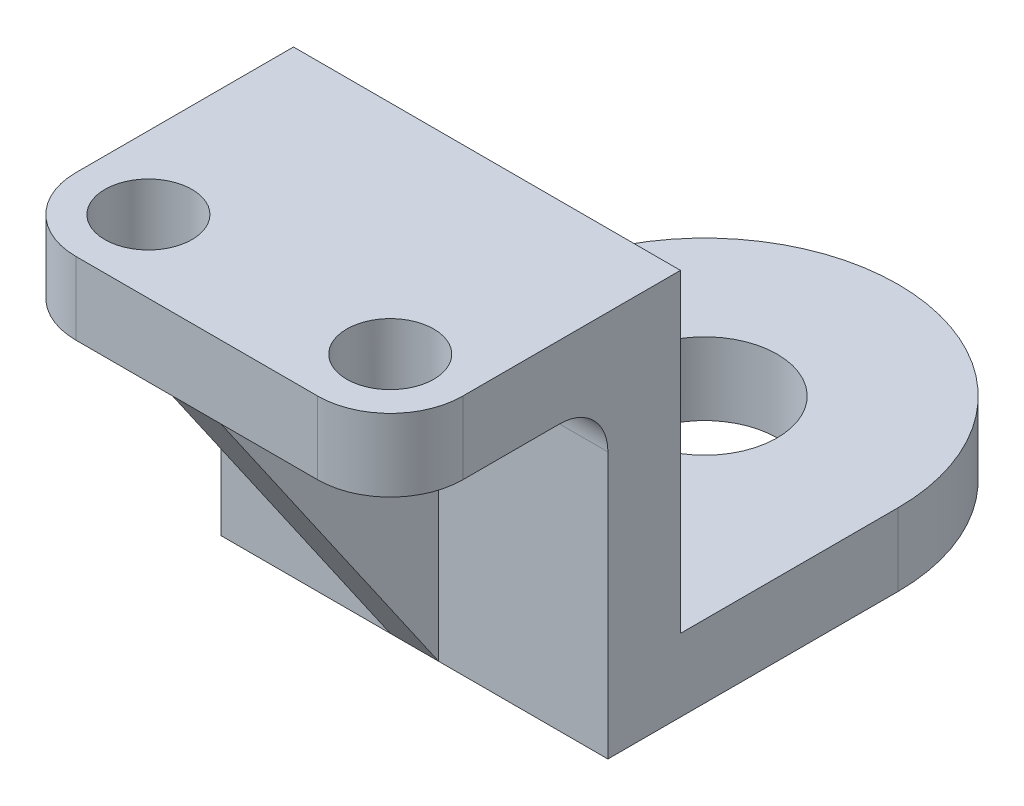
ISO-10303-21;
HEADER;
FILE_DESCRIPTION(('STEP AP214'),'2;1');
FILE_NAME('part.step','',(''),(''),'','','');
FILE_SCHEMA(('AUTOMOTIVE_DESIGN { 1 0 10303 214 1 1 1 1 }'));
ENDSEC;
DATA;
#1=APPLICATION_CONTEXT('core data for automotive mechanical design processes');
#2=APPLICATION_PROTOCOL_DEFINITION('international standard','automotive_design',2000,#1);
#3=PRODUCT_CONTEXT('',#1,'mechanical');
#4=PRODUCT('Part','Part','',(#3));
#5=PRODUCT_RELATED_PRODUCT_CATEGORY('part','',(#4));
#6=PRODUCT_DEFINITION_FORMATION('','',#4);
#7=PRODUCT_DEFINITION_CONTEXT('part definition',#1,'design');
#8=PRODUCT_DEFINITION('design','',#6,#7);
#9=PRODUCT_DEFINITION_SHAPE('','',#8);
#10=(LENGTH_UNIT() NAMED_UNIT(*) SI_UNIT(.MILLI.,.METRE.));
#11=(NAMED_UNIT(*) PLANE_ANGLE_UNIT() SI_UNIT($,.RADIAN.));
#12=(NAMED_UNIT(*) SI_UNIT($,.STERADIAN.) SOLID_ANGLE_UNIT());
#13=UNCERTAINTY_MEASURE_WITH_UNIT(LENGTH_MEASURE(1.E-05),#10,'distance_accuracy_value','');
#14=(GEOMETRIC_REPRESENTATION_CONTEXT(3) GLOBAL_UNCERTAINTY_ASSIGNED_CONTEXT((#13)) GLOBAL_UNIT_ASSIGNED_CONTEXT((#10,
#11,#12)) REPRESENTATION_CONTEXT('',''));
#15=CARTESIAN_POINT('',(0.,0.,0.));
#16=DIRECTION('',(0.,0.,1.));
#17=DIRECTION('',(1.,0.,0.));
#18=AXIS2_PLACEMENT_3D('',#15,#16,#17);
#19=CARTESIAN_POINT('',(40.,0.,100.));
#20=DIRECTION('',(0.,0.,-1.));
#21=DIRECTION('',(0.,1.,0.));
#22=AXIS2_PLACEMENT_3D('',#19,#20,#21);
#23=PLANE('',#22);
#24=DIRECTION('',(0.,-1.,0.));
#25=VECTOR('',#24,1.);
#26=CARTESIAN_POINT('',(-5.,0.,100.));
#27=LINE('',#26,#25);
#28=CARTESIAN_POINT('',(-5.,-25.,100.));
#29=VERTEX_POINT('',#28);
#30=CARTESIAN_POINT('',(-5.,-80.,100.));
#31=VERTEX_POINT('',#30);
#32=EDGE_CURVE('E166',#29,#31,#27,.T.);
#33=ORIENTED_EDGE('',*,*,#32,.F.);
#34=DIRECTION('',(-1.,0.,0.));
#35=VECTOR('',#34,1.);
#36=CARTESIAN_POINT('',(-40.,-25.,100.));
#37=LINE('',#36,#35);
#38=CARTESIAN_POINT('',(-40.,-25.,100.));
#39=VERTEX_POINT('',#38);
#40=EDGE_CURVE('E155',#29,#39,#37,.T.);
#41=ORIENTED_EDGE('',*,*,#40,.T.);
#42=DIRECTION('',(0.,-1.,0.));
#43=VECTOR('',#42,1.);
#44=CARTESIAN_POINT('',(-40.,0.,100.));
#45=LINE('',#44,#43);
#46=CARTESIAN_POINT('',(-40.,-80.,100.));
#47=VERTEX_POINT('',#46);
#48=EDGE_CURVE('E240',#39,#47,#45,.T.);
#49=ORIENTED_EDGE('',*,*,#48,.T.);
#50=DIRECTION('',(-1.,0.,0.));
#51=VECTOR('',#50,1.);
#52=CARTESIAN_POINT('',(40.,-80.,100.));
#53=LINE('',#52,#51);
#54=EDGE_CURVE('E56',#31,#47,#53,.T.);
#55=ORIENTED_EDGE('',*,*,#54,.F.);
#56=EDGE_LOOP('',(#33,#41,#49,#55));
#57=FACE_BOUND('',#56,.T.);
#58=ADVANCED_FACE('F41',(#57),#23,.F.);
#59=CARTESIAN_POINT('',(40.,-15.,145.));
#60=DIRECTION('',(0.,1.,0.));
#61=DIRECTION('',(0.,0.,1.));
#62=AXIS2_PLACEMENT_3D('',#59,#60,#61);
#63=PLANE('',#62);
#64=CARTESIAN_POINT('',(-25.,-15.,130.));
#65=DIRECTION('',(0.,1.,0.));
#66=DIRECTION('',(0.,0.,1.));
#67=AXIS2_PLACEMENT_3D('',#64,#65,#66);
#68=CIRCLE('',#67,9.00000000000001);
#69=CARTESIAN_POINT('',(-25.,-15.,139.));
#70=VERTEX_POINT('',#69);
#71=EDGE_CURVE('E204',#70,#70,#68,.T.);
#72=ORIENTED_EDGE('',*,*,#71,.T.);
#73=EDGE_LOOP('',(#72));
#74=FACE_BOUND('',#73,.T.);
#75=DIRECTION('',(0.,0.,-1.));
#76=VECTOR('',#75,1.);
#77=CARTESIAN_POINT('',(-5.,-15.,145.));
#78=LINE('',#77,#76);
#79=CARTESIAN_POINT('',(-5.,-15.,145.));
#80=VERTEX_POINT('',#79);
#81=CARTESIAN_POINT('',(-5.,-15.,110.));
#82=VERTEX_POINT('',#81);
#83=EDGE_CURVE('E171',#80,#82,#78,.T.);
#84=ORIENTED_EDGE('',*,*,#83,.F.);
#85=DIRECTION('',(-1.,0.,0.));
#86=VECTOR('',#85,1.);
#87=CARTESIAN_POINT('',(40.,-15.,145.));
#88=LINE('',#87,#86);
#89=CARTESIAN_POINT('',(-25.,-15.,145.));
#90=VERTEX_POINT('',#89);
#91=EDGE_CURVE('E266',#80,#90,#88,.T.);
#92=ORIENTED_EDGE('',*,*,#91,.T.);
#93=CARTESIAN_POINT('',(-25.,-15.,130.));
#94=DIRECTION('',(0.,1.,0.));
#95=DIRECTION('',(0.,0.,1.));
#96=AXIS2_PLACEMENT_3D('',#93,#94,#95);
#97=CIRCLE('',#96,15.);
#98=CARTESIAN_POINT('',(-40.,-15.,130.));
#99=VERTEX_POINT('',#98);
#100=EDGE_CURVE('E225',#90,#99,#97,.F.);
#101=ORIENTED_EDGE('',*,*,#100,.T.);
#102=DIRECTION('',(0.,0.,-1.));
#103=VECTOR('',#102,1.);
#104=CARTESIAN_POINT('',(-40.,-15.,145.));
#105=LINE('',#104,#103);
#106=CARTESIAN_POINT('',(-40.,-15.,110.));
#107=VERTEX_POINT('',#106);
#108=EDGE_CURVE('E207',#99,#107,#105,.T.);
#109=ORIENTED_EDGE('',*,*,#108,.T.);
#110=DIRECTION('',(-1.,0.,0.));
#111=VECTOR('',#110,1.);
#112=CARTESIAN_POINT('',(40.,-15.,110.));
#113=LINE('',#112,#111);
#114=EDGE_CURVE('E179',#107,#82,#113,.F.);
#115=ORIENTED_EDGE('',*,*,#114,.T.);
#116=EDGE_LOOP('',(#84,#92,#101,#109,#115));
#117=FACE_BOUND('',#116,.T.);
#118=ADVANCED_FACE('F324',(#74,#117),#63,.F.);
#119=CARTESIAN_POINT('',(40.,-25.,110.));
#120=DIRECTION('',(1.,0.,0.));
#121=DIRECTION('',(0.,0.,-1.));
#122=AXIS2_PLACEMENT_3D('',#119,#120,#121);
#123=CYLINDRICAL_SURFACE('',#122,10.);
#124=CARTESIAN_POINT('',(-5.,-25.,110.));
#125=DIRECTION('',(1.,0.,0.));
#126=DIRECTION('',(0.,0.,-1.));
#127=AXIS2_PLACEMENT_3D('',#124,#125,#126);
#128=CIRCLE('',#127,10.);
#129=EDGE_CURVE('E49',#82,#29,#128,.F.);
#130=ORIENTED_EDGE('',*,*,#129,.F.);
#131=ORIENTED_EDGE('',*,*,#114,.F.);
#132=CARTESIAN_POINT('',(-40.,-25.,110.));
#133=DIRECTION('',(1.,0.,0.));
#134=DIRECTION('',(0.,0.,-1.));
#135=AXIS2_PLACEMENT_3D('',#132,#133,#134);
#136=CIRCLE('',#135,10.);
#137=EDGE_CURVE('E160',#39,#107,#136,.T.);
#138=ORIENTED_EDGE('',*,*,#137,.F.);
#139=ORIENTED_EDGE('',*,*,#40,.F.);
#140=EDGE_LOOP('',(#130,#131,#138,#139));
#141=FACE_BOUND('',#140,.T.);
#142=ADVANCED_FACE('F156',(#141),#123,.F.);
#143=CARTESIAN_POINT('',(40.,-65.,0.));
#144=DIRECTION('',(0.,-1.,0.));
#145=DIRECTION('',(0.,0.,-1.));
#146=AXIS2_PLACEMENT_3D('',#143,#144,#145);
#147=PLANE('',#146);
#148=CARTESIAN_POINT('',(0.,-65.,40.));
#149=DIRECTION('',(0.,-1.,0.));
#150=DIRECTION('',(0.,0.,-1.));
#151=AXIS2_PLACEMENT_3D('',#148,#149,#150);
#152=CIRCLE('',#151,15.);
#153=CARTESIAN_POINT('',(0.,-65.,25.));
#154=VERTEX_POINT('',#153);
#155=EDGE_CURVE('E185',#154,#154,#152,.T.);
#156=ORIENTED_EDGE('',*,*,#155,.T.);
#157=EDGE_LOOP('',(#156));
#158=FACE_BOUND('',#157,.T.);
#159=CARTESIAN_POINT('',(0.,-65.,40.));
#160=DIRECTION('',(0.,-1.,0.));
#161=DIRECTION('',(0.,0.,-1.));
#162=AXIS2_PLACEMENT_3D('',#159,#160,#161);
#163=CIRCLE('',#162,40.);
#164=CARTESIAN_POINT('',(40.,-65.,40.));
#165=VERTEX_POINT('',#164);
#166=CARTESIAN_POINT('',(0.,-65.,0.));
#167=VERTEX_POINT('',#166);
#168=EDGE_CURVE('E201',#165,#167,#163,.F.);
#169=ORIENTED_EDGE('',*,*,#168,.T.);
#170=CARTESIAN_POINT('',(0.,-65.,40.));
#171=DIRECTION('',(0.,-1.,0.));
#172=DIRECTION('',(0.,0.,-1.));
#173=AXIS2_PLACEMENT_3D('',#170,#171,#172);
#174=CIRCLE('',#173,40.);
#175=CARTESIAN_POINT('',(-40.,-65.,40.));
#176=VERTEX_POINT('',#175);
#177=EDGE_CURVE('E199',#167,#176,#174,.F.);
#178=ORIENTED_EDGE('',*,*,#177,.T.);
#179=DIRECTION('',(0.,0.,1.));
#180=VECTOR('',#179,1.);
#181=CARTESIAN_POINT('',(-40.,-65.,0.));
#182=LINE('',#181,#180);
#183=CARTESIAN_POINT('',(-40.,-65.,85.));
#184=VERTEX_POINT('',#183);
#185=EDGE_CURVE('E248',#176,#184,#182,.T.);
#186=ORIENTED_EDGE('',*,*,#185,.T.);
#187=DIRECTION('',(-1.,0.,0.));
#188=VECTOR('',#187,1.);
#189=CARTESIAN_POINT('',(40.,-65.,85.));
#190=LINE('',#189,#188);
#191=CARTESIAN_POINT('',(40.,-65.,85.));
#192=VERTEX_POINT('',#191);
#193=EDGE_CURVE('E230',#192,#184,#190,.T.);
#194=ORIENTED_EDGE('',*,*,#193,.F.);
#195=DIRECTION('',(0.,0.,1.));
#196=VECTOR('',#195,1.);
#197=CARTESIAN_POINT('',(40.,-65.,0.));
#198=LINE('',#197,#196);
#199=EDGE_CURVE('E239',#165,#192,#198,.T.);
#200=ORIENTED_EDGE('',*,*,#199,.F.);
#201=EDGE_LOOP('',(#169,#178,#186,#194,#200));
#202=FACE_BOUND('',#201,.T.);
#203=ADVANCED_FACE('F352',(#158,#202),#147,.F.);
#204=CARTESIAN_POINT('',(40.,-65.,85.));
#205=DIRECTION('',(0.,0.,1.));
#206=DIRECTION('',(1.,0.,0.));
#207=AXIS2_PLACEMENT_3D('',#204,#205,#206);
#208=PLANE('',#207);
#209=ORIENTED_EDGE('',*,*,#193,.T.);
#210=DIRECTION('',(0.,1.,0.));
#211=VECTOR('',#210,1.);
#212=CARTESIAN_POINT('',(-40.,-65.,85.));
#213=LINE('',#212,#211);
#214=CARTESIAN_POINT('',(-40.,0.,85.));
#215=VERTEX_POINT('',#214);
#216=EDGE_CURVE('E245',#184,#215,#213,.T.);
#217=ORIENTED_EDGE('',*,*,#216,.T.);
#218=DIRECTION('',(-1.,0.,0.));
#219=VECTOR('',#218,1.);
#220=CARTESIAN_POINT('',(40.,0.,85.));
#221=LINE('',#220,#219);
#222=CARTESIAN_POINT('',(40.,0.,85.));
#223=VERTEX_POINT('',#222);
#224=EDGE_CURVE('E232',#223,#215,#221,.T.);
#225=ORIENTED_EDGE('',*,*,#224,.F.);
#226=DIRECTION('',(0.,1.,0.));
#227=VECTOR('',#226,1.);
#228=CARTESIAN_POINT('',(40.,-65.,85.));
#229=LINE('',#228,#227);
#230=EDGE_CURVE('E260',#192,#223,#229,.T.);
#231=ORIENTED_EDGE('',*,*,#230,.F.);
#232=EDGE_LOOP('',(#209,#217,#225,#231));
#233=FACE_BOUND('',#232,.T.);
#234=ADVANCED_FACE('F357',(#233),#208,.F.);
#235=CARTESIAN_POINT('',(40.,0.,85.));
#236=DIRECTION('',(0.,-1.,0.));
#237=DIRECTION('',(0.,0.,-1.));
#238=AXIS2_PLACEMENT_3D('',#235,#236,#237);
#239=PLANE('',#238);
#240=CARTESIAN_POINT('',(25.,0.,130.));
#241=DIRECTION('',(0.,1.,0.));
#242=DIRECTION('',(0.,0.,-1.));
#243=AXIS2_PLACEMENT_3D('',#240,#241,#242);
#244=CIRCLE('',#243,9.00000000000001);
#245=CARTESIAN_POINT('',(25.,0.,121.));
#246=VERTEX_POINT('',#245);
#247=EDGE_CURVE('E190',#246,#246,#244,.T.);
#248=ORIENTED_EDGE('',*,*,#247,.F.);
#249=EDGE_LOOP('',(#248));
#250=FACE_BOUND('',#249,.T.);
#251=ORIENTED_EDGE('',*,*,#224,.T.);
#252=DIRECTION('',(0.,0.,1.));
#253=VECTOR('',#252,1.);
#254=CARTESIAN_POINT('',(-40.,0.,85.));
#255=LINE('',#254,#253);
#256=CARTESIAN_POINT('',(-40.,0.,130.));
#257=VERTEX_POINT('',#256);
#258=EDGE_CURVE('E242',#215,#257,#255,.T.);
#259=ORIENTED_EDGE('',*,*,#258,.T.);
#260=CARTESIAN_POINT('',(-25.,0.,130.));
#261=DIRECTION('',(0.,-1.,0.));
#262=DIRECTION('',(0.,0.,-1.));
#263=AXIS2_PLACEMENT_3D('',#260,#261,#262);
#264=CIRCLE('',#263,15.);
#265=CARTESIAN_POINT('',(-25.,0.,145.));
#266=VERTEX_POINT('',#265);
#267=EDGE_CURVE('E215',#257,#266,#264,.F.);
#268=ORIENTED_EDGE('',*,*,#267,.T.);
#269=DIRECTION('',(-1.,0.,0.));
#270=VECTOR('',#269,1.);
#271=CARTESIAN_POINT('',(40.,0.,145.));
#272=LINE('',#271,#270);
#273=CARTESIAN_POINT('',(25.,0.,145.));
#274=VERTEX_POINT('',#273);
#275=EDGE_CURVE('E267',#274,#266,#272,.T.);
#276=ORIENTED_EDGE('',*,*,#275,.F.);
#277=CARTESIAN_POINT('',(25.,0.,130.));
#278=DIRECTION('',(0.,-1.,0.));
#279=DIRECTION('',(0.,0.,-1.));
#280=AXIS2_PLACEMENT_3D('',#277,#278,#279);
#281=CIRCLE('',#280,15.);
#282=CARTESIAN_POINT('',(40.,0.,130.));
#283=VERTEX_POINT('',#282);
#284=EDGE_CURVE('E213',#274,#283,#281,.F.);
#285=ORIENTED_EDGE('',*,*,#284,.T.);
#286=DIRECTION('',(0.,0.,1.));
#287=VECTOR('',#286,1.);
#288=CARTESIAN_POINT('',(40.,0.,85.));
#289=LINE('',#288,#287);
#290=EDGE_CURVE('E257',#223,#283,#289,.T.);
#291=ORIENTED_EDGE('',*,*,#290,.F.);
#292=EDGE_LOOP('',(#251,#259,#268,#276,#285,#291));
#293=FACE_BOUND('',#292,.T.);
#294=CARTESIAN_POINT('',(-25.,0.,130.));
#295=DIRECTION('',(0.,1.,0.));
#296=DIRECTION('',(0.,0.,1.));
#297=AXIS2_PLACEMENT_3D('',#294,#295,#296);
#298=CIRCLE('',#297,9.00000000000001);
#299=CARTESIAN_POINT('',(-25.,0.,139.));
#300=VERTEX_POINT('',#299);
#301=EDGE_CURVE('E211',#300,#300,#298,.T.);
#302=ORIENTED_EDGE('',*,*,#301,.F.);
#303=EDGE_LOOP('',(#302));
#304=FACE_BOUND('',#303,.T.);
#305=ADVANCED_FACE('F332',(#250,#293,#304),#239,.F.);
#306=CARTESIAN_POINT('',(40.,-25.,100.));
#307=VERTEX_POINT('',#306);
#308=CARTESIAN_POINT('',(5.,-25.,100.));
#309=VERTEX_POINT('',#308);
#310=EDGE_CURVE('E162',#307,#309,#37,.T.);
#311=ORIENTED_EDGE('',*,*,#310,.T.);
#312=DIRECTION('',(0.,-1.,0.));
#313=VECTOR('',#312,1.);
#314=CARTESIAN_POINT('',(5.,0.,100.));
#315=LINE('',#314,#313);
#316=CARTESIAN_POINT('',(5.,-80.,100.));
#317=VERTEX_POINT('',#316);
#318=EDGE_CURVE('E64',#309,#317,#315,.T.);
#319=ORIENTED_EDGE('',*,*,#318,.T.);
#320=CARTESIAN_POINT('',(40.,-80.,100.));
#321=VERTEX_POINT('',#320);
#322=EDGE_CURVE('E234',#321,#317,#53,.T.);
#323=ORIENTED_EDGE('',*,*,#322,.F.);
#324=DIRECTION('',(0.,-1.,0.));
#325=VECTOR('',#324,1.);
#326=CARTESIAN_POINT('',(40.,0.,100.));
#327=LINE('',#326,#325);
#328=EDGE_CURVE('E255',#307,#321,#327,.T.);
#329=ORIENTED_EDGE('',*,*,#328,.F.);
#330=EDGE_LOOP('',(#311,#319,#323,#329));
#331=FACE_BOUND('',#330,.T.);
#332=ADVANCED_FACE('F301',(#331),#23,.F.);
#333=CARTESIAN_POINT('',(40.,-80.,100.));
#334=DIRECTION('',(0.,1.,0.));
#335=DIRECTION('',(0.,0.,1.));
#336=AXIS2_PLACEMENT_3D('',#333,#334,#335);
#337=PLANE('',#336);
#338=CARTESIAN_POINT('',(0.,-80.,40.));
#339=DIRECTION('',(0.,1.,0.));
#340=DIRECTION('',(0.,0.,1.));
#341=AXIS2_PLACEMENT_3D('',#338,#339,#340);
#342=CIRCLE('',#341,15.);
#343=CARTESIAN_POINT('',(0.,-80.,55.));
#344=VERTEX_POINT('',#343);
#345=EDGE_CURVE('E182',#344,#344,#342,.T.);
#346=ORIENTED_EDGE('',*,*,#345,.T.);
#347=EDGE_LOOP('',(#346));
#348=FACE_BOUND('',#347,.T.);
#349=ORIENTED_EDGE('',*,*,#322,.T.);
#350=DIRECTION('',(1.,0.,0.));
#351=VECTOR('',#350,1.);
#352=CARTESIAN_POINT('',(40.,-80.,100.));
#353=LINE('',#352,#351);
#354=EDGE_CURVE('E186',#31,#317,#353,.T.);
#355=ORIENTED_EDGE('',*,*,#354,.F.);
#356=ORIENTED_EDGE('',*,*,#54,.T.);
#357=DIRECTION('',(0.,0.,-1.));
#358=VECTOR('',#357,1.);
#359=CARTESIAN_POINT('',(-40.,-80.,100.));
#360=LINE('',#359,#358);
#361=CARTESIAN_POINT('',(-40.,-80.,40.));
#362=VERTEX_POINT('',#361);
#363=EDGE_CURVE('E236',#47,#362,#360,.T.);
#364=ORIENTED_EDGE('',*,*,#363,.T.);
#365=CARTESIAN_POINT('',(0.,-80.,40.));
#366=DIRECTION('',(0.,1.,0.));
#367=DIRECTION('',(0.,0.,1.));
#368=AXIS2_PLACEMENT_3D('',#365,#366,#367);
#369=CIRCLE('',#368,40.);
#370=CARTESIAN_POINT('',(0.,-80.,0.));
#371=VERTEX_POINT('',#370);
#372=EDGE_CURVE('E192',#362,#371,#369,.F.);
#373=ORIENTED_EDGE('',*,*,#372,.T.);
#374=CARTESIAN_POINT('',(0.,-80.,40.));
#375=DIRECTION('',(0.,1.,0.));
#376=DIRECTION('',(0.,0.,1.));
#377=AXIS2_PLACEMENT_3D('',#374,#375,#376);
#378=CIRCLE('',#377,40.);
#379=CARTESIAN_POINT('',(40.,-80.,40.));
#380=VERTEX_POINT('',#379);
#381=EDGE_CURVE('E194',#371,#380,#378,.F.);
#382=ORIENTED_EDGE('',*,*,#381,.T.);
#383=DIRECTION('',(0.,0.,-1.));
#384=VECTOR('',#383,1.);
#385=CARTESIAN_POINT('',(40.,-80.,100.));
#386=LINE('',#385,#384);
#387=EDGE_CURVE('E252',#321,#380,#386,.T.);
#388=ORIENTED_EDGE('',*,*,#387,.F.);
#389=EDGE_LOOP('',(#349,#355,#356,#364,#373,#382,#388));
#390=FACE_BOUND('',#389,.T.);
#391=ADVANCED_FACE('F298',(#348,#390),#337,.F.);
#392=CARTESIAN_POINT('',(40.,0.,0.));
#393=DIRECTION('',(1.,0.,0.));
#394=DIRECTION('',(0.,0.,-1.));
#395=AXIS2_PLACEMENT_3D('',#392,#393,#394);
#396=PLANE('',#395);
#397=ORIENTED_EDGE('',*,*,#387,.T.);
#398=DIRECTION('',(0.,1.,0.));
#399=VECTOR('',#398,1.);
#400=CARTESIAN_POINT('',(40.,-65.,40.));
#401=LINE('',#400,#399);
#402=EDGE_CURVE('E163',#380,#165,#401,.T.);
#403=ORIENTED_EDGE('',*,*,#402,.T.);
#404=ORIENTED_EDGE('',*,*,#199,.T.);
#405=ORIENTED_EDGE('',*,*,#230,.T.);
#406=ORIENTED_EDGE('',*,*,#290,.T.);
#407=DIRECTION('',(0.,-1.,0.));
#408=VECTOR('',#407,1.);
#409=CARTESIAN_POINT('',(40.,-15.,130.));
#410=LINE('',#409,#408);
#411=CARTESIAN_POINT('',(40.,-15.,130.));
#412=VERTEX_POINT('',#411);
#413=EDGE_CURVE('E227',#283,#412,#410,.T.);
#414=ORIENTED_EDGE('',*,*,#413,.T.);
#415=DIRECTION('',(0.,0.,-1.));
#416=VECTOR('',#415,1.);
#417=CARTESIAN_POINT('',(40.,-15.,145.));
#418=LINE('',#417,#416);
#419=CARTESIAN_POINT('',(40.,-15.,110.));
#420=VERTEX_POINT('',#419);
#421=EDGE_CURVE('E269',#412,#420,#418,.T.);
#422=ORIENTED_EDGE('',*,*,#421,.T.);
#423=CARTESIAN_POINT('',(40.,-25.,110.));
#424=DIRECTION('',(1.,0.,0.));
#425=DIRECTION('',(0.,0.,-1.));
#426=AXIS2_PLACEMENT_3D('',#423,#424,#425);
#427=CIRCLE('',#426,10.);
#428=EDGE_CURVE('E175',#420,#307,#427,.F.);
#429=ORIENTED_EDGE('',*,*,#428,.T.);
#430=ORIENTED_EDGE('',*,*,#328,.T.);
#431=EDGE_LOOP('',(#397,#403,#404,#405,#406,#414,#422,#429,#430));
#432=FACE_BOUND('',#431,.T.);
#433=ADVANCED_FACE('F310',(#432),#396,.T.);
#434=CARTESIAN_POINT('',(-40.,0.,0.));
#435=DIRECTION('',(1.,0.,0.));
#436=DIRECTION('',(0.,0.,-1.));
#437=AXIS2_PLACEMENT_3D('',#434,#435,#436);
#438=PLANE('',#437);
#439=ORIENTED_EDGE('',*,*,#185,.F.);
#440=DIRECTION('',(0.,1.,0.));
#441=VECTOR('',#440,1.);
#442=CARTESIAN_POINT('',(-40.,0.,40.));
#443=LINE('',#442,#441);
#444=EDGE_CURVE('E196',#176,#362,#443,.F.);
#445=ORIENTED_EDGE('',*,*,#444,.T.);
#446=ORIENTED_EDGE('',*,*,#363,.F.);
#447=ORIENTED_EDGE('',*,*,#48,.F.);
#448=ORIENTED_EDGE('',*,*,#137,.T.);
#449=ORIENTED_EDGE('',*,*,#108,.F.);
#450=DIRECTION('',(0.,-1.,0.));
#451=VECTOR('',#450,1.);
#452=CARTESIAN_POINT('',(-40.,0.,130.));
#453=LINE('',#452,#451);
#454=EDGE_CURVE('E203',#99,#257,#453,.F.);
#455=ORIENTED_EDGE('',*,*,#454,.T.);
#456=ORIENTED_EDGE('',*,*,#258,.F.);
#457=ORIENTED_EDGE('',*,*,#216,.F.);
#458=EDGE_LOOP('',(#439,#445,#446,#447,#448,#449,#455,#456,#457));
#459=FACE_BOUND('',#458,.T.);
#460=ADVANCED_FACE('F339',(#459),#438,.F.);
#461=CARTESIAN_POINT('',(40.,0.,145.));
#462=DIRECTION('',(0.,0.,-1.));
#463=DIRECTION('',(-1.,0.,0.));
#464=AXIS2_PLACEMENT_3D('',#461,#462,#463);
#465=PLANE('',#464);
#466=ORIENTED_EDGE('',*,*,#275,.T.);
#467=DIRECTION('',(0.,-1.,0.));
#468=VECTOR('',#467,1.);
#469=CARTESIAN_POINT('',(-25.,0.,145.));
#470=LINE('',#469,#468);
#471=EDGE_CURVE('E220',#266,#90,#470,.T.);
#472=ORIENTED_EDGE('',*,*,#471,.T.);
#473=ORIENTED_EDGE('',*,*,#91,.F.);
#474=CARTESIAN_POINT('',(5.,-15.,145.));
#475=VERTEX_POINT('',#474);
#476=EDGE_CURVE('E265',#475,#80,#88,.T.);
#477=ORIENTED_EDGE('',*,*,#476,.F.);
#478=CARTESIAN_POINT('',(25.,-15.,145.));
#479=VERTEX_POINT('',#478);
#480=EDGE_CURVE('E251',#479,#475,#88,.T.);
#481=ORIENTED_EDGE('',*,*,#480,.F.);
#482=DIRECTION('',(0.,-1.,0.));
#483=VECTOR('',#482,1.);
#484=CARTESIAN_POINT('',(25.,0.,145.));
#485=LINE('',#484,#483);
#486=EDGE_CURVE('E218',#479,#274,#485,.F.);
#487=ORIENTED_EDGE('',*,*,#486,.T.);
#488=EDGE_LOOP('',(#466,#472,#473,#477,#481,#487));
#489=FACE_BOUND('',#488,.T.);
#490=ADVANCED_FACE('F319',(#489),#465,.F.);
#491=CARTESIAN_POINT('',(25.,-15.,130.));
#492=DIRECTION('',(0.,1.,0.));
#493=DIRECTION('',(0.,0.,1.));
#494=AXIS2_PLACEMENT_3D('',#491,#492,#493);
#495=CIRCLE('',#494,9.00000000000001);
#496=CARTESIAN_POINT('',(25.,-15.,139.));
#497=VERTEX_POINT('',#496);
#498=EDGE_CURVE('E208',#497,#497,#495,.T.);
#499=ORIENTED_EDGE('',*,*,#498,.T.);
#500=EDGE_LOOP('',(#499));
#501=FACE_BOUND('',#500,.T.);
#502=ORIENTED_EDGE('',*,*,#480,.T.);
#503=DIRECTION('',(0.,0.,-1.));
#504=VECTOR('',#503,1.);
#505=CARTESIAN_POINT('',(5.,-15.,145.));
#506=LINE('',#505,#504);
#507=CARTESIAN_POINT('',(5.,-15.,110.));
#508=VERTEX_POINT('',#507);
#509=EDGE_CURVE('E170',#475,#508,#506,.T.);
#510=ORIENTED_EDGE('',*,*,#509,.T.);
#511=EDGE_CURVE('E180',#508,#420,#113,.F.);
#512=ORIENTED_EDGE('',*,*,#511,.T.);
#513=ORIENTED_EDGE('',*,*,#421,.F.);
#514=CARTESIAN_POINT('',(25.,-15.,130.));
#515=DIRECTION('',(0.,1.,0.));
#516=DIRECTION('',(0.,0.,1.));
#517=AXIS2_PLACEMENT_3D('',#514,#515,#516);
#518=CIRCLE('',#517,15.);
#519=EDGE_CURVE('E223',#412,#479,#518,.F.);
#520=ORIENTED_EDGE('',*,*,#519,.T.);
#521=EDGE_LOOP('',(#502,#510,#512,#513,#520));
#522=FACE_BOUND('',#521,.T.);
#523=ADVANCED_FACE('F309',(#501,#522),#63,.F.);
#524=CARTESIAN_POINT('',(25.,0.,130.));
#525=DIRECTION('',(0.,1.,0.));
#526=DIRECTION('',(0.,0.,1.));
#527=AXIS2_PLACEMENT_3D('',#524,#525,#526);
#528=CYLINDRICAL_SURFACE('',#527,15.);
#529=ORIENTED_EDGE('',*,*,#284,.F.);
#530=ORIENTED_EDGE('',*,*,#486,.F.);
#531=ORIENTED_EDGE('',*,*,#519,.F.);
#532=ORIENTED_EDGE('',*,*,#413,.F.);
#533=EDGE_LOOP('',(#529,#530,#531,#532));
#534=FACE_BOUND('',#533,.T.);
#535=ADVANCED_FACE('F315',(#534),#528,.T.);
#536=CARTESIAN_POINT('',(-25.,0.,130.));
#537=DIRECTION('',(0.,-1.,0.));
#538=DIRECTION('',(0.,0.,-1.));
#539=AXIS2_PLACEMENT_3D('',#536,#537,#538);
#540=CYLINDRICAL_SURFACE('',#539,15.);
#541=ORIENTED_EDGE('',*,*,#267,.F.);
#542=ORIENTED_EDGE('',*,*,#454,.F.);
#543=ORIENTED_EDGE('',*,*,#100,.F.);
#544=ORIENTED_EDGE('',*,*,#471,.F.);
#545=EDGE_LOOP('',(#541,#542,#543,#544));
#546=FACE_BOUND('',#545,.T.);
#547=ADVANCED_FACE('F330',(#546),#540,.T.);
#548=CARTESIAN_POINT('',(25.,-80.,130.));
#549=DIRECTION('',(0.,1.,0.));
#550=DIRECTION('',(0.,0.,1.));
#551=AXIS2_PLACEMENT_3D('',#548,#549,#550);
#552=CYLINDRICAL_SURFACE('',#551,9.00000000000001);
#553=ORIENTED_EDGE('',*,*,#247,.T.);
#554=EDGE_LOOP('',(#553));
#555=FACE_BOUND('',#554,.T.);
#556=ORIENTED_EDGE('',*,*,#498,.F.);
#557=EDGE_LOOP('',(#556));
#558=FACE_BOUND('',#557,.T.);
#559=ADVANCED_FACE('F392',(#555,#558),#552,.F.);
#560=CARTESIAN_POINT('',(-25.,-80.,130.));
#561=DIRECTION('',(0.,1.,0.));
#562=DIRECTION('',(0.,0.,1.));
#563=AXIS2_PLACEMENT_3D('',#560,#561,#562);
#564=CYLINDRICAL_SURFACE('',#563,9.00000000000001);
#565=ORIENTED_EDGE('',*,*,#301,.T.);
#566=EDGE_LOOP('',(#565));
#567=FACE_BOUND('',#566,.T.);
#568=ORIENTED_EDGE('',*,*,#71,.F.);
#569=EDGE_LOOP('',(#568));
#570=FACE_BOUND('',#569,.T.);
#571=ADVANCED_FACE('F395',(#567,#570),#564,.F.);
#572=CARTESIAN_POINT('',(0.,0.,40.));
#573=DIRECTION('',(0.,-1.,0.));
#574=DIRECTION('',(0.,0.,-1.));
#575=AXIS2_PLACEMENT_3D('',#572,#573,#574);
#576=CYLINDRICAL_SURFACE('',#575,40.);
#577=ORIENTED_EDGE('',*,*,#402,.F.);
#578=ORIENTED_EDGE('',*,*,#381,.F.);
#579=DIRECTION('',(0.,1.,0.));
#580=VECTOR('',#579,1.);
#581=CARTESIAN_POINT('',(0.,-80.,0.));
#582=LINE('',#581,#580);
#583=EDGE_CURVE('E187',#167,#371,#582,.F.);
#584=ORIENTED_EDGE('',*,*,#583,.F.);
#585=ORIENTED_EDGE('',*,*,#168,.F.);
#586=EDGE_LOOP('',(#577,#578,#584,#585));
#587=FACE_BOUND('',#586,.T.);
#588=ADVANCED_FACE('F347',(#587),#576,.T.);
#589=CARTESIAN_POINT('',(0.,-80.,40.));
#590=DIRECTION('',(0.,1.,0.));
#591=DIRECTION('',(0.,0.,1.));
#592=AXIS2_PLACEMENT_3D('',#589,#590,#591);
#593=CYLINDRICAL_SURFACE('',#592,40.);
#594=ORIENTED_EDGE('',*,*,#583,.T.);
#595=ORIENTED_EDGE('',*,*,#372,.F.);
#596=ORIENTED_EDGE('',*,*,#444,.F.);
#597=ORIENTED_EDGE('',*,*,#177,.F.);
#598=EDGE_LOOP('',(#594,#595,#596,#597));
#599=FACE_BOUND('',#598,.T.);
#600=ADVANCED_FACE('F350',(#599),#593,.T.);
#601=CARTESIAN_POINT('',(0.,0.,40.));
#602=DIRECTION('',(0.,-1.,0.));
#603=DIRECTION('',(0.,0.,-1.));
#604=AXIS2_PLACEMENT_3D('',#601,#602,#603);
#605=CYLINDRICAL_SURFACE('',#604,15.);
#606=ORIENTED_EDGE('',*,*,#155,.F.);
#607=EDGE_LOOP('',(#606));
#608=FACE_BOUND('',#607,.T.);
#609=ORIENTED_EDGE('',*,*,#345,.F.);
#610=EDGE_LOOP('',(#609));
#611=FACE_BOUND('',#610,.T.);
#612=ADVANCED_FACE('F400',(#608,#611),#605,.F.);
#613=ORIENTED_EDGE('',*,*,#511,.F.);
#614=CARTESIAN_POINT('',(5.,-25.,110.));
#615=DIRECTION('',(1.,0.,0.));
#616=DIRECTION('',(0.,0.,-1.));
#617=AXIS2_PLACEMENT_3D('',#614,#615,#616);
#618=CIRCLE('',#617,10.);
#619=EDGE_CURVE('E11',#508,#309,#618,.F.);
#620=ORIENTED_EDGE('',*,*,#619,.T.);
#621=ORIENTED_EDGE('',*,*,#310,.F.);
#622=ORIENTED_EDGE('',*,*,#428,.F.);
#623=EDGE_LOOP('',(#613,#620,#621,#622));
#624=FACE_BOUND('',#623,.T.);
#625=ADVANCED_FACE('F43',(#624),#123,.F.);
#626=CARTESIAN_POINT('',(0.,-15.,145.));
#627=DIRECTION('',(0.,-0.569209978830308,0.822192191643779));
#628=DIRECTION('',(0.,-0.822192191643779,-0.569209978830308));
#629=AXIS2_PLACEMENT_3D('',#626,#627,#628);
#630=PLANE('',#629);
#631=DIRECTION('',(0.,-0.822192191643779,-0.569209978830308));
#632=VECTOR('',#631,1.);
#633=CARTESIAN_POINT('',(-5.,-15.,145.));
#634=LINE('',#633,#632);
#635=EDGE_CURVE('E286',#80,#31,#634,.T.);
#636=ORIENTED_EDGE('',*,*,#635,.T.);
#637=ORIENTED_EDGE('',*,*,#354,.T.);
#638=DIRECTION('',(0.,-0.822192191643779,-0.569209978830308));
#639=VECTOR('',#638,1.);
#640=CARTESIAN_POINT('',(5.,-15.,145.));
#641=LINE('',#640,#639);
#642=EDGE_CURVE('E285',#475,#317,#641,.T.);
#643=ORIENTED_EDGE('',*,*,#642,.F.);
#644=ORIENTED_EDGE('',*,*,#476,.T.);
#645=EDGE_LOOP('',(#636,#637,#643,#644));
#646=FACE_BOUND('',#645,.T.);
#647=ADVANCED_FACE('F296',(#646),#630,.T.);
#648=CARTESIAN_POINT('',(5.,-40.,72.5));
#649=DIRECTION('',(1.,0.,0.));
#650=DIRECTION('',(0.,0.,-1.));
#651=AXIS2_PLACEMENT_3D('',#648,#649,#650);
#652=PLANE('',#651);
#653=ORIENTED_EDGE('',*,*,#318,.F.);
#654=ORIENTED_EDGE('',*,*,#619,.F.);
#655=ORIENTED_EDGE('',*,*,#509,.F.);
#656=ORIENTED_EDGE('',*,*,#642,.T.);
#657=EDGE_LOOP('',(#653,#654,#655,#656));
#658=FACE_BOUND('',#657,.T.);
#659=ADVANCED_FACE('F292',(#658),#652,.T.);
#660=CARTESIAN_POINT('',(-5.,-40.,72.5));
#661=DIRECTION('',(1.,0.,0.));
#662=DIRECTION('',(0.,0.,-1.));
#663=AXIS2_PLACEMENT_3D('',#660,#661,#662);
#664=PLANE('',#663);
#665=ORIENTED_EDGE('',*,*,#129,.T.);
#666=ORIENTED_EDGE('',*,*,#32,.T.);
#667=ORIENTED_EDGE('',*,*,#635,.F.);
#668=ORIENTED_EDGE('',*,*,#83,.T.);
#669=EDGE_LOOP('',(#665,#666,#667,#668));
#670=FACE_BOUND('',#669,.T.);
#671=ADVANCED_FACE('F174',(#670),#664,.F.);
#672=CLOSED_SHELL('',(#58,#118,#142,#203,#234,#305,#332,#391,#433,#460,#490,#523,#535,#547,#559,
#571,#588,#600,#612,#625,#647,#659,#671));
#673=MANIFOLD_SOLID_BREP('B2',#672);
#674=ADVANCED_BREP_SHAPE_REPRESENTATION('',(#18,#673),#14);
#675=SHAPE_DEFINITION_REPRESENTATION(#9,#674);
ENDSEC;
END-ISO-10303-21;
